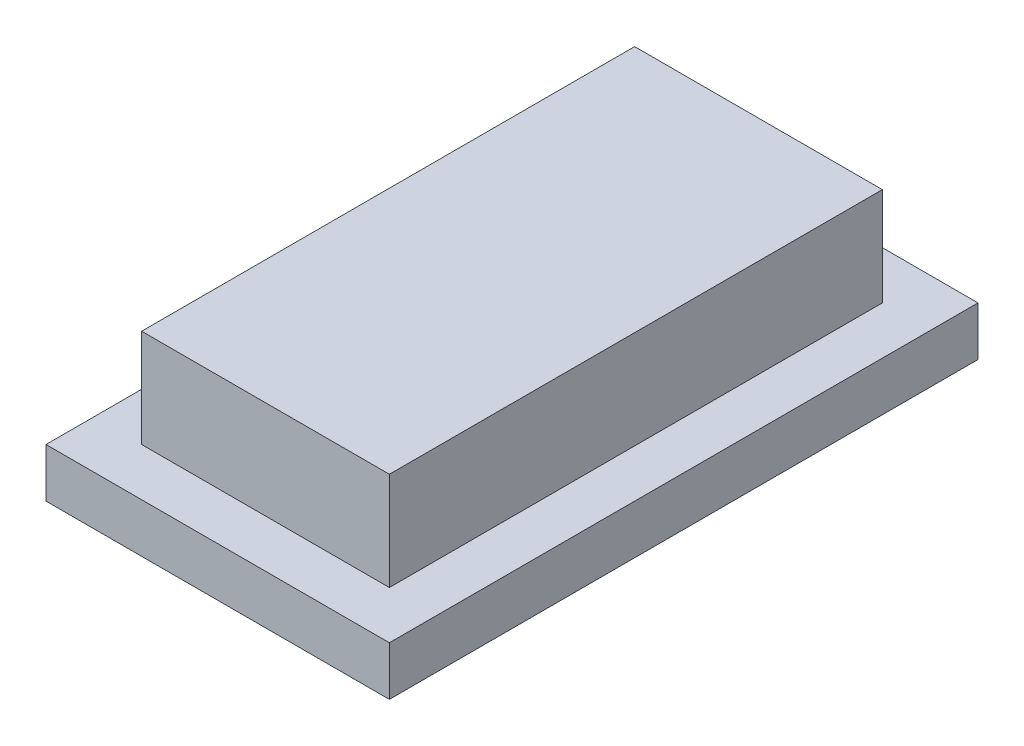
ISO-10303-21;
HEADER;
FILE_DESCRIPTION(('STEP AP214'),'2;1');
FILE_NAME('part.step','',(''),(''),'','','');
FILE_SCHEMA(('AUTOMOTIVE_DESIGN { 1 0 10303 214 1 1 1 1 }'));
ENDSEC;
DATA;
#1=APPLICATION_CONTEXT('core data for automotive mechanical design processes');
#2=APPLICATION_PROTOCOL_DEFINITION('international standard','automotive_design',2000,#1);
#3=PRODUCT_CONTEXT('',#1,'mechanical');
#4=PRODUCT('Part','Part','',(#3));
#5=PRODUCT_RELATED_PRODUCT_CATEGORY('part','',(#4));
#6=PRODUCT_DEFINITION_FORMATION('','',#4);
#7=PRODUCT_DEFINITION_CONTEXT('part definition',#1,'design');
#8=PRODUCT_DEFINITION('design','',#6,#7);
#9=PRODUCT_DEFINITION_SHAPE('','',#8);
#10=(LENGTH_UNIT() NAMED_UNIT(*) SI_UNIT(.MILLI.,.METRE.));
#11=(NAMED_UNIT(*) PLANE_ANGLE_UNIT() SI_UNIT($,.RADIAN.));
#12=(NAMED_UNIT(*) SI_UNIT($,.STERADIAN.) SOLID_ANGLE_UNIT());
#13=UNCERTAINTY_MEASURE_WITH_UNIT(LENGTH_MEASURE(1.E-05),#10,'distance_accuracy_value','');
#14=(GEOMETRIC_REPRESENTATION_CONTEXT(3) GLOBAL_UNCERTAINTY_ASSIGNED_CONTEXT((#13)) GLOBAL_UNIT_ASSIGNED_CONTEXT((#10,
#11,#12)) REPRESENTATION_CONTEXT('',''));
#15=CARTESIAN_POINT('',(0.,0.,0.));
#16=DIRECTION('',(0.,0.,1.));
#17=DIRECTION('',(1.,0.,0.));
#18=AXIS2_PLACEMENT_3D('',#15,#16,#17);
#19=CARTESIAN_POINT('',(0.,2.,0.));
#20=DIRECTION('',(0.,1.,0.));
#21=DIRECTION('',(0.,0.,1.));
#22=AXIS2_PLACEMENT_3D('',#19,#20,#21);
#23=PLANE('',#22);
#24=DIRECTION('',(0.,0.,1.));
#25=VECTOR('',#24,1.);
#26=CARTESIAN_POINT('',(-7.,2.,12.));
#27=LINE('',#26,#25);
#28=CARTESIAN_POINT('',(-7.,2.,-12.));
#29=VERTEX_POINT('',#28);
#30=CARTESIAN_POINT('',(-7.,2.,12.));
#31=VERTEX_POINT('',#30);
#32=EDGE_CURVE('E142',#29,#31,#27,.T.);
#33=ORIENTED_EDGE('',*,*,#32,.T.);
#34=DIRECTION('',(1.,0.,0.));
#35=VECTOR('',#34,1.);
#36=CARTESIAN_POINT('',(7.,2.,12.));
#37=LINE('',#36,#35);
#38=CARTESIAN_POINT('',(7.,2.,12.));
#39=VERTEX_POINT('',#38);
#40=EDGE_CURVE('E87',#31,#39,#37,.T.);
#41=ORIENTED_EDGE('',*,*,#40,.T.);
#42=DIRECTION('',(0.,0.,-1.));
#43=VECTOR('',#42,1.);
#44=CARTESIAN_POINT('',(7.,2.,12.));
#45=LINE('',#44,#43);
#46=CARTESIAN_POINT('',(7.,2.,-12.));
#47=VERTEX_POINT('',#46);
#48=EDGE_CURVE('E145',#39,#47,#45,.T.);
#49=ORIENTED_EDGE('',*,*,#48,.T.);
#50=DIRECTION('',(-1.,0.,0.));
#51=VECTOR('',#50,1.);
#52=CARTESIAN_POINT('',(7.,2.,-12.));
#53=LINE('',#52,#51);
#54=EDGE_CURVE('E59',#47,#29,#53,.T.);
#55=ORIENTED_EDGE('',*,*,#54,.T.);
#56=EDGE_LOOP('',(#33,#41,#49,#55));
#57=FACE_BOUND('',#56,.T.);
#58=DIRECTION('',(1.,0.,0.));
#59=VECTOR('',#58,1.);
#60=CARTESIAN_POINT('',(5.05,2.,10.05));
#61=LINE('',#60,#59);
#62=CARTESIAN_POINT('',(-5.05,2.,10.05));
#63=VERTEX_POINT('',#62);
#64=CARTESIAN_POINT('',(5.05,2.,10.05));
#65=VERTEX_POINT('',#64);
#66=EDGE_CURVE('E265',#63,#65,#61,.T.);
#67=ORIENTED_EDGE('',*,*,#66,.F.);
#68=DIRECTION('',(0.,0.,1.));
#69=VECTOR('',#68,1.);
#70=CARTESIAN_POINT('',(-5.05,2.,10.05));
#71=LINE('',#70,#69);
#72=CARTESIAN_POINT('',(-5.05,2.,-10.05));
#73=VERTEX_POINT('',#72);
#74=EDGE_CURVE('E132',#73,#63,#71,.T.);
#75=ORIENTED_EDGE('',*,*,#74,.F.);
#76=DIRECTION('',(-1.,0.,0.));
#77=VECTOR('',#76,1.);
#78=CARTESIAN_POINT('',(5.05,2.,-10.05));
#79=LINE('',#78,#77);
#80=CARTESIAN_POINT('',(5.05,2.,-10.05));
#81=VERTEX_POINT('',#80);
#82=EDGE_CURVE('E128',#81,#73,#79,.T.);
#83=ORIENTED_EDGE('',*,*,#82,.F.);
#84=DIRECTION('',(0.,0.,-1.));
#85=VECTOR('',#84,1.);
#86=CARTESIAN_POINT('',(5.05,2.,10.05));
#87=LINE('',#86,#85);
#88=EDGE_CURVE('E262',#65,#81,#87,.T.);
#89=ORIENTED_EDGE('',*,*,#88,.F.);
#90=EDGE_LOOP('',(#67,#75,#83,#89));
#91=FACE_BOUND('',#90,.T.);
#92=ADVANCED_FACE('F35',(#57,#91),#23,.T.);
#93=CARTESIAN_POINT('',(-7.,2.,12.));
#94=DIRECTION('',(1.,0.,0.));
#95=DIRECTION('',(0.,0.,-1.));
#96=AXIS2_PLACEMENT_3D('',#93,#94,#95);
#97=PLANE('',#96);
#98=DIRECTION('',(0.,0.,1.));
#99=VECTOR('',#98,1.);
#100=CARTESIAN_POINT('',(-7.,0.,12.));
#101=LINE('',#100,#99);
#102=CARTESIAN_POINT('',(-7.,0.,-12.));
#103=VERTEX_POINT('',#102);
#104=CARTESIAN_POINT('',(-7.,0.,12.));
#105=VERTEX_POINT('',#104);
#106=EDGE_CURVE('E134',#103,#105,#101,.T.);
#107=ORIENTED_EDGE('',*,*,#106,.T.);
#108=DIRECTION('',(0.,-1.,0.));
#109=VECTOR('',#108,1.);
#110=CARTESIAN_POINT('',(-7.,2.,12.));
#111=LINE('',#110,#109);
#112=EDGE_CURVE('E11',#31,#105,#111,.T.);
#113=ORIENTED_EDGE('',*,*,#112,.F.);
#114=ORIENTED_EDGE('',*,*,#32,.F.);
#115=DIRECTION('',(0.,-1.,0.));
#116=VECTOR('',#115,1.);
#117=CARTESIAN_POINT('',(-7.,2.,-12.));
#118=LINE('',#117,#116);
#119=EDGE_CURVE('E147',#29,#103,#118,.T.);
#120=ORIENTED_EDGE('',*,*,#119,.T.);
#121=EDGE_LOOP('',(#107,#113,#114,#120));
#122=FACE_BOUND('',#121,.T.);
#123=ADVANCED_FACE('F37',(#122),#97,.F.);
#124=CARTESIAN_POINT('',(7.,2.,12.));
#125=DIRECTION('',(0.,0.,-1.));
#126=DIRECTION('',(-1.,0.,0.));
#127=AXIS2_PLACEMENT_3D('',#124,#125,#126);
#128=PLANE('',#127);
#129=DIRECTION('',(1.,0.,0.));
#130=VECTOR('',#129,1.);
#131=CARTESIAN_POINT('',(7.,0.,12.));
#132=LINE('',#131,#130);
#133=CARTESIAN_POINT('',(7.,0.,12.));
#134=VERTEX_POINT('',#133);
#135=EDGE_CURVE('E137',#105,#134,#132,.T.);
#136=ORIENTED_EDGE('',*,*,#135,.T.);
#137=DIRECTION('',(0.,-1.,0.));
#138=VECTOR('',#137,1.);
#139=CARTESIAN_POINT('',(7.,2.,12.));
#140=LINE('',#139,#138);
#141=EDGE_CURVE('E43',#39,#134,#140,.T.);
#142=ORIENTED_EDGE('',*,*,#141,.F.);
#143=ORIENTED_EDGE('',*,*,#40,.F.);
#144=ORIENTED_EDGE('',*,*,#112,.T.);
#145=EDGE_LOOP('',(#136,#142,#143,#144));
#146=FACE_BOUND('',#145,.T.);
#147=ADVANCED_FACE('F175',(#146),#128,.F.);
#148=CARTESIAN_POINT('',(7.,2.,12.));
#149=DIRECTION('',(-1.,0.,0.));
#150=DIRECTION('',(0.,0.,1.));
#151=AXIS2_PLACEMENT_3D('',#148,#149,#150);
#152=PLANE('',#151);
#153=DIRECTION('',(0.,0.,-1.));
#154=VECTOR('',#153,1.);
#155=CARTESIAN_POINT('',(7.,0.,12.));
#156=LINE('',#155,#154);
#157=CARTESIAN_POINT('',(7.,0.,-12.));
#158=VERTEX_POINT('',#157);
#159=EDGE_CURVE('E150',#134,#158,#156,.T.);
#160=ORIENTED_EDGE('',*,*,#159,.T.);
#161=DIRECTION('',(0.,-1.,0.));
#162=VECTOR('',#161,1.);
#163=CARTESIAN_POINT('',(7.,2.,-12.));
#164=LINE('',#163,#162);
#165=EDGE_CURVE('E154',#47,#158,#164,.T.);
#166=ORIENTED_EDGE('',*,*,#165,.F.);
#167=ORIENTED_EDGE('',*,*,#48,.F.);
#168=ORIENTED_EDGE('',*,*,#141,.T.);
#169=EDGE_LOOP('',(#160,#166,#167,#168));
#170=FACE_BOUND('',#169,.T.);
#171=ADVANCED_FACE('F159',(#170),#152,.F.);
#172=CARTESIAN_POINT('',(7.,2.,-12.));
#173=DIRECTION('',(0.,0.,1.));
#174=DIRECTION('',(1.,0.,0.));
#175=AXIS2_PLACEMENT_3D('',#172,#173,#174);
#176=PLANE('',#175);
#177=DIRECTION('',(-1.,0.,0.));
#178=VECTOR('',#177,1.);
#179=CARTESIAN_POINT('',(7.,0.,-12.));
#180=LINE('',#179,#178);
#181=EDGE_CURVE('E80',#158,#103,#180,.T.);
#182=ORIENTED_EDGE('',*,*,#181,.T.);
#183=ORIENTED_EDGE('',*,*,#119,.F.);
#184=ORIENTED_EDGE('',*,*,#54,.F.);
#185=ORIENTED_EDGE('',*,*,#165,.T.);
#186=EDGE_LOOP('',(#182,#183,#184,#185));
#187=FACE_BOUND('',#186,.T.);
#188=ADVANCED_FACE('F167',(#187),#176,.F.);
#189=CARTESIAN_POINT('',(0.,0.,0.));
#190=DIRECTION('',(0.,1.,0.));
#191=DIRECTION('',(0.,0.,1.));
#192=AXIS2_PLACEMENT_3D('',#189,#190,#191);
#193=PLANE('',#192);
#194=ORIENTED_EDGE('',*,*,#106,.F.);
#195=ORIENTED_EDGE('',*,*,#181,.F.);
#196=ORIENTED_EDGE('',*,*,#159,.F.);
#197=ORIENTED_EDGE('',*,*,#135,.F.);
#198=EDGE_LOOP('',(#194,#195,#196,#197));
#199=FACE_BOUND('',#198,.T.);
#200=ADVANCED_FACE('F163',(#199),#193,.F.);
#201=CARTESIAN_POINT('',(-5.05,6.,10.05));
#202=DIRECTION('',(1.,0.,0.));
#203=DIRECTION('',(0.,0.,-1.));
#204=AXIS2_PLACEMENT_3D('',#201,#202,#203);
#205=PLANE('',#204);
#206=ORIENTED_EDGE('',*,*,#74,.T.);
#207=DIRECTION('',(0.,-1.,0.));
#208=VECTOR('',#207,1.);
#209=CARTESIAN_POINT('',(-5.05,6.,10.05));
#210=LINE('',#209,#208);
#211=CARTESIAN_POINT('',(-5.05,6.,10.05));
#212=VERTEX_POINT('',#211);
#213=EDGE_CURVE('E113',#212,#63,#210,.T.);
#214=ORIENTED_EDGE('',*,*,#213,.F.);
#215=DIRECTION('',(0.,0.,1.));
#216=VECTOR('',#215,1.);
#217=CARTESIAN_POINT('',(-5.05,6.,10.05));
#218=LINE('',#217,#216);
#219=CARTESIAN_POINT('',(-5.05,6.,-10.05));
#220=VERTEX_POINT('',#219);
#221=EDGE_CURVE('E120',#220,#212,#218,.T.);
#222=ORIENTED_EDGE('',*,*,#221,.F.);
#223=DIRECTION('',(0.,-1.,0.));
#224=VECTOR('',#223,1.);
#225=CARTESIAN_POINT('',(-5.05,6.,-10.05));
#226=LINE('',#225,#224);
#227=EDGE_CURVE('E260',#220,#73,#226,.T.);
#228=ORIENTED_EDGE('',*,*,#227,.T.);
#229=EDGE_LOOP('',(#206,#214,#222,#228));
#230=FACE_BOUND('',#229,.T.);
#231=ADVANCED_FACE('F130',(#230),#205,.F.);
#232=CARTESIAN_POINT('',(5.05,6.,10.05));
#233=DIRECTION('',(0.,0.,-1.));
#234=DIRECTION('',(-1.,0.,0.));
#235=AXIS2_PLACEMENT_3D('',#232,#233,#234);
#236=PLANE('',#235);
#237=ORIENTED_EDGE('',*,*,#66,.T.);
#238=DIRECTION('',(0.,-1.,0.));
#239=VECTOR('',#238,1.);
#240=CARTESIAN_POINT('',(5.05,6.,10.05));
#241=LINE('',#240,#239);
#242=CARTESIAN_POINT('',(5.05,6.,10.05));
#243=VERTEX_POINT('',#242);
#244=EDGE_CURVE('E116',#243,#65,#241,.T.);
#245=ORIENTED_EDGE('',*,*,#244,.F.);
#246=DIRECTION('',(1.,0.,0.));
#247=VECTOR('',#246,1.);
#248=CARTESIAN_POINT('',(5.05,6.,10.05));
#249=LINE('',#248,#247);
#250=EDGE_CURVE('E109',#212,#243,#249,.T.);
#251=ORIENTED_EDGE('',*,*,#250,.F.);
#252=ORIENTED_EDGE('',*,*,#213,.T.);
#253=EDGE_LOOP('',(#237,#245,#251,#252));
#254=FACE_BOUND('',#253,.T.);
#255=ADVANCED_FACE('F111',(#254),#236,.F.);
#256=CARTESIAN_POINT('',(5.05,6.,10.05));
#257=DIRECTION('',(-1.,0.,0.));
#258=DIRECTION('',(0.,0.,1.));
#259=AXIS2_PLACEMENT_3D('',#256,#257,#258);
#260=PLANE('',#259);
#261=ORIENTED_EDGE('',*,*,#88,.T.);
#262=DIRECTION('',(0.,-1.,0.));
#263=VECTOR('',#262,1.);
#264=CARTESIAN_POINT('',(5.05,6.,-10.05));
#265=LINE('',#264,#263);
#266=CARTESIAN_POINT('',(5.05,6.,-10.05));
#267=VERTEX_POINT('',#266);
#268=EDGE_CURVE('E50',#267,#81,#265,.T.);
#269=ORIENTED_EDGE('',*,*,#268,.F.);
#270=DIRECTION('',(0.,0.,-1.));
#271=VECTOR('',#270,1.);
#272=CARTESIAN_POINT('',(5.05,6.,10.05));
#273=LINE('',#272,#271);
#274=EDGE_CURVE('E119',#243,#267,#273,.T.);
#275=ORIENTED_EDGE('',*,*,#274,.F.);
#276=ORIENTED_EDGE('',*,*,#244,.T.);
#277=EDGE_LOOP('',(#261,#269,#275,#276));
#278=FACE_BOUND('',#277,.T.);
#279=ADVANCED_FACE('F188',(#278),#260,.F.);
#280=CARTESIAN_POINT('',(5.05,6.,-10.05));
#281=DIRECTION('',(0.,0.,1.));
#282=DIRECTION('',(1.,0.,0.));
#283=AXIS2_PLACEMENT_3D('',#280,#281,#282);
#284=PLANE('',#283);
#285=ORIENTED_EDGE('',*,*,#82,.T.);
#286=ORIENTED_EDGE('',*,*,#227,.F.);
#287=DIRECTION('',(-1.,0.,0.));
#288=VECTOR('',#287,1.);
#289=CARTESIAN_POINT('',(5.05,6.,-10.05));
#290=LINE('',#289,#288);
#291=EDGE_CURVE('E124',#267,#220,#290,.T.);
#292=ORIENTED_EDGE('',*,*,#291,.F.);
#293=ORIENTED_EDGE('',*,*,#268,.T.);
#294=EDGE_LOOP('',(#285,#286,#292,#293));
#295=FACE_BOUND('',#294,.T.);
#296=ADVANCED_FACE('F191',(#295),#284,.F.);
#297=CARTESIAN_POINT('',(0.,6.,0.));
#298=DIRECTION('',(0.,1.,0.));
#299=DIRECTION('',(0.,0.,1.));
#300=AXIS2_PLACEMENT_3D('',#297,#298,#299);
#301=PLANE('',#300);
#302=ORIENTED_EDGE('',*,*,#221,.T.);
#303=ORIENTED_EDGE('',*,*,#250,.T.);
#304=ORIENTED_EDGE('',*,*,#274,.T.);
#305=ORIENTED_EDGE('',*,*,#291,.T.);
#306=EDGE_LOOP('',(#302,#303,#304,#305));
#307=FACE_BOUND('',#306,.T.);
#308=ADVANCED_FACE('F123',(#307),#301,.T.);
#309=CLOSED_SHELL('',(#92,#123,#147,#171,#188,#200,#231,#255,#279,#296,#308));
#310=MANIFOLD_SOLID_BREP('B2',#309);
#311=ADVANCED_BREP_SHAPE_REPRESENTATION('',(#18,#310),#14);
#312=SHAPE_DEFINITION_REPRESENTATION(#9,#311);
ENDSEC;
END-ISO-10303-21;
